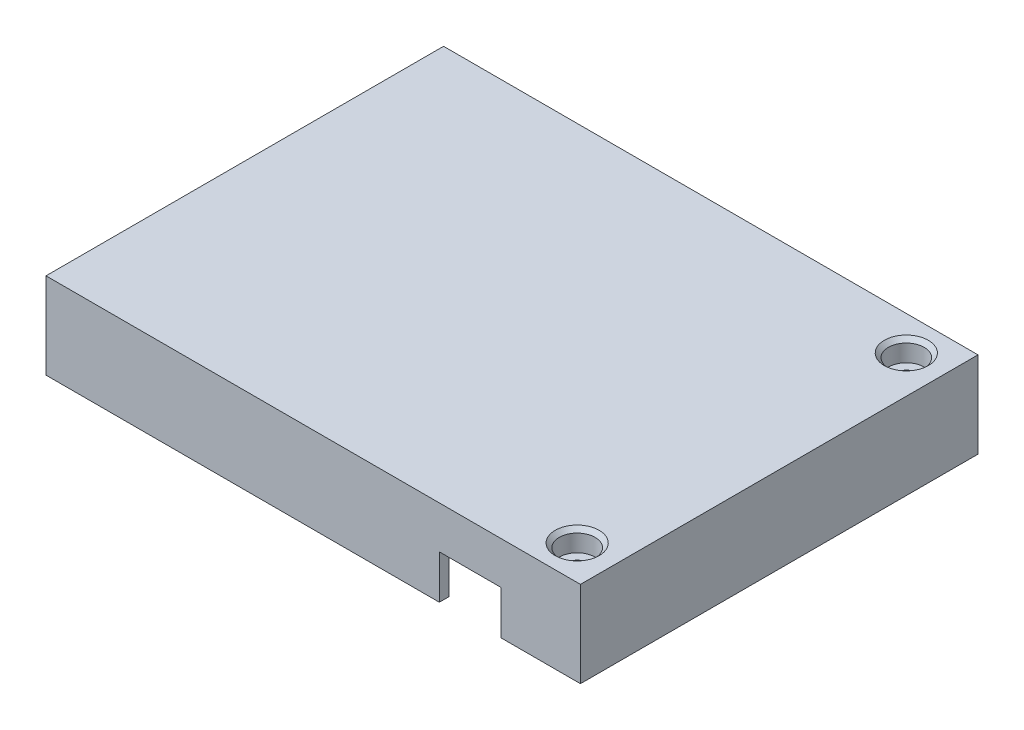
ISO-10303-21;
HEADER;
FILE_DESCRIPTION(('STEP AP214'),'2;1');
FILE_NAME('part.step','',(''),(''),'','','');
FILE_SCHEMA(('AUTOMOTIVE_DESIGN { 1 0 10303 214 1 1 1 1 }'));
ENDSEC;
DATA;
#1=APPLICATION_CONTEXT('core data for automotive mechanical design processes');
#2=APPLICATION_PROTOCOL_DEFINITION('international standard','automotive_design',2000,#1);
#3=PRODUCT_CONTEXT('',#1,'mechanical');
#4=PRODUCT('Part','Part','',(#3));
#5=PRODUCT_RELATED_PRODUCT_CATEGORY('part','',(#4));
#6=PRODUCT_DEFINITION_FORMATION('','',#4);
#7=PRODUCT_DEFINITION_CONTEXT('part definition',#1,'design');
#8=PRODUCT_DEFINITION('design','',#6,#7);
#9=PRODUCT_DEFINITION_SHAPE('','',#8);
#10=(LENGTH_UNIT() NAMED_UNIT(*) SI_UNIT(.MILLI.,.METRE.));
#11=(NAMED_UNIT(*) PLANE_ANGLE_UNIT() SI_UNIT($,.RADIAN.));
#12=(NAMED_UNIT(*) SI_UNIT($,.STERADIAN.) SOLID_ANGLE_UNIT());
#13=UNCERTAINTY_MEASURE_WITH_UNIT(LENGTH_MEASURE(1.E-05),#10,'distance_accuracy_value','');
#14=(GEOMETRIC_REPRESENTATION_CONTEXT(3) GLOBAL_UNCERTAINTY_ASSIGNED_CONTEXT((#13)) GLOBAL_UNIT_ASSIGNED_CONTEXT((#10,
#11,#12)) REPRESENTATION_CONTEXT('',''));
#15=CARTESIAN_POINT('',(0.,0.,0.));
#16=DIRECTION('',(0.,0.,1.));
#17=DIRECTION('',(1.,0.,0.));
#18=AXIS2_PLACEMENT_3D('',#15,#16,#17);
#19=CARTESIAN_POINT('',(-41.,13.2,29.));
#20=DIRECTION('',(0.,0.,-1.));
#21=DIRECTION('',(-1.,0.,0.));
#22=AXIS2_PLACEMENT_3D('',#19,#20,#21);
#23=PLANE('',#22);
#24=DIRECTION('',(-1.,0.,0.));
#25=VECTOR('',#24,1.);
#26=CARTESIAN_POINT('',(19.35,6.7,29.));
#27=LINE('',#26,#25);
#28=CARTESIAN_POINT('',(28.85,6.7,29.));
#29=VERTEX_POINT('',#28);
#30=CARTESIAN_POINT('',(19.35,6.7,29.));
#31=VERTEX_POINT('',#30);
#32=EDGE_CURVE('E244',#29,#31,#27,.T.);
#33=ORIENTED_EDGE('',*,*,#32,.T.);
#34=DIRECTION('',(0.,-1.,0.));
#35=VECTOR('',#34,1.);
#36=CARTESIAN_POINT('',(19.35,0.,29.));
#37=LINE('',#36,#35);
#38=CARTESIAN_POINT('',(19.35,0.,29.));
#39=VERTEX_POINT('',#38);
#40=EDGE_CURVE('E472',#31,#39,#37,.T.);
#41=ORIENTED_EDGE('',*,*,#40,.T.);
#42=DIRECTION('',(1.,0.,0.));
#43=VECTOR('',#42,1.);
#44=CARTESIAN_POINT('',(0.,0.,29.));
#45=LINE('',#44,#43);
#46=CARTESIAN_POINT('',(-33.15,0.,29.));
#47=VERTEX_POINT('',#46);
#48=EDGE_CURVE('E263',#47,#39,#45,.T.);
#49=ORIENTED_EDGE('',*,*,#48,.F.);
#50=DIRECTION('',(0.,1.,0.));
#51=VECTOR('',#50,1.);
#52=CARTESIAN_POINT('',(-33.15,-3.57770876399966,29.));
#53=LINE('',#52,#51);
#54=CARTESIAN_POINT('',(-33.15,1.7,29.));
#55=VERTEX_POINT('',#54);
#56=EDGE_CURVE('E421',#47,#55,#53,.T.);
#57=ORIENTED_EDGE('',*,*,#56,.T.);
#58=DIRECTION('',(1.,0.,0.));
#59=VECTOR('',#58,1.);
#60=CARTESIAN_POINT('',(-39.5,1.7,29.));
#61=LINE('',#60,#59);
#62=CARTESIAN_POINT('',(-31.75,1.7,29.));
#63=VERTEX_POINT('',#62);
#64=EDGE_CURVE('E452',#55,#63,#61,.T.);
#65=ORIENTED_EDGE('',*,*,#64,.T.);
#66=DIRECTION('',(0.,1.,0.));
#67=VECTOR('',#66,1.);
#68=CARTESIAN_POINT('',(-31.75,-10.9601551083915,29.));
#69=LINE('',#68,#67);
#70=CARTESIAN_POINT('',(-31.75,11.7,29.));
#71=VERTEX_POINT('',#70);
#72=EDGE_CURVE('E364',#63,#71,#69,.T.);
#73=ORIENTED_EDGE('',*,*,#72,.T.);
#74=DIRECTION('',(1.,0.,0.));
#75=VECTOR('',#74,1.);
#76=CARTESIAN_POINT('',(0.,11.7,29.));
#77=LINE('',#76,#75);
#78=CARTESIAN_POINT('',(31.75,11.7,29.));
#79=VERTEX_POINT('',#78);
#80=EDGE_CURVE('E297',#71,#79,#77,.T.);
#81=ORIENTED_EDGE('',*,*,#80,.T.);
#82=DIRECTION('',(0.,1.,0.));
#83=VECTOR('',#82,1.);
#84=CARTESIAN_POINT('',(31.75,-10.9601551083915,29.));
#85=LINE('',#84,#83);
#86=CARTESIAN_POINT('',(31.75,1.7,29.));
#87=VERTEX_POINT('',#86);
#88=EDGE_CURVE('E332',#87,#79,#85,.T.);
#89=ORIENTED_EDGE('',*,*,#88,.F.);
#90=DIRECTION('',(-1.,0.,0.));
#91=VECTOR('',#90,1.);
#92=CARTESIAN_POINT('',(39.5,1.7,29.));
#93=LINE('',#92,#91);
#94=CARTESIAN_POINT('',(39.5,1.7,29.));
#95=VERTEX_POINT('',#94);
#96=EDGE_CURVE('E314',#95,#87,#93,.T.);
#97=ORIENTED_EDGE('',*,*,#96,.F.);
#98=DIRECTION('',(0.,-1.,0.));
#99=VECTOR('',#98,1.);
#100=CARTESIAN_POINT('',(39.5,13.2,29.));
#101=LINE('',#100,#99);
#102=CARTESIAN_POINT('',(39.5,0.,29.));
#103=VERTEX_POINT('',#102);
#104=EDGE_CURVE('E260',#95,#103,#101,.T.);
#105=ORIENTED_EDGE('',*,*,#104,.T.);
#106=CARTESIAN_POINT('',(28.85,0.,29.));
#107=VERTEX_POINT('',#106);
#108=EDGE_CURVE('E251',#107,#103,#45,.T.);
#109=ORIENTED_EDGE('',*,*,#108,.F.);
#110=DIRECTION('',(0.,1.,0.));
#111=VECTOR('',#110,1.);
#112=CARTESIAN_POINT('',(28.85,0.,29.));
#113=LINE('',#112,#111);
#114=EDGE_CURVE('E234',#107,#29,#113,.T.);
#115=ORIENTED_EDGE('',*,*,#114,.T.);
#116=EDGE_LOOP('',(#33,#41,#49,#57,#65,#73,#81,#89,#97,#105,#109,#115));
#117=FACE_BOUND('',#116,.T.);
#118=ADVANCED_FACE('F49',(#117),#23,.T.);
#119=CARTESIAN_POINT('',(0.,0.,0.));
#120=DIRECTION('',(0.,-1.,0.));
#121=DIRECTION('',(0.,0.,-1.));
#122=AXIS2_PLACEMENT_3D('',#119,#120,#121);
#123=PLANE('',#122);
#124=ORIENTED_EDGE('',*,*,#48,.T.);
#125=DIRECTION('',(0.,0.,-1.));
#126=VECTOR('',#125,1.);
#127=CARTESIAN_POINT('',(19.35,0.,30.500012));
#128=LINE('',#127,#126);
#129=CARTESIAN_POINT('',(19.35,0.,30.5));
#130=VERTEX_POINT('',#129);
#131=EDGE_CURVE('E256',#130,#39,#128,.T.);
#132=ORIENTED_EDGE('',*,*,#131,.F.);
#133=DIRECTION('',(1.,0.,0.));
#134=VECTOR('',#133,1.);
#135=CARTESIAN_POINT('',(-41.,0.,30.5));
#136=LINE('',#135,#134);
#137=CARTESIAN_POINT('',(-41.,0.,30.5));
#138=VERTEX_POINT('',#137);
#139=EDGE_CURVE('E477',#138,#130,#136,.T.);
#140=ORIENTED_EDGE('',*,*,#139,.F.);
#141=DIRECTION('',(0.,0.,1.));
#142=VECTOR('',#141,1.);
#143=CARTESIAN_POINT('',(-41.,0.,30.5));
#144=LINE('',#143,#142);
#145=CARTESIAN_POINT('',(-41.,0.,-30.5));
#146=VERTEX_POINT('',#145);
#147=EDGE_CURVE('E498',#146,#138,#144,.T.);
#148=ORIENTED_EDGE('',*,*,#147,.F.);
#149=DIRECTION('',(-1.,0.,0.));
#150=VECTOR('',#149,1.);
#151=CARTESIAN_POINT('',(-41.,0.,-30.5));
#152=LINE('',#151,#150);
#153=CARTESIAN_POINT('',(41.,0.,-30.5));
#154=VERTEX_POINT('',#153);
#155=EDGE_CURVE('E625',#154,#146,#152,.T.);
#156=ORIENTED_EDGE('',*,*,#155,.F.);
#157=DIRECTION('',(0.,0.,-1.));
#158=VECTOR('',#157,1.);
#159=CARTESIAN_POINT('',(41.,0.,30.5));
#160=LINE('',#159,#158);
#161=CARTESIAN_POINT('',(41.,0.,30.5));
#162=VERTEX_POINT('',#161);
#163=EDGE_CURVE('E622',#162,#154,#160,.T.);
#164=ORIENTED_EDGE('',*,*,#163,.F.);
#165=CARTESIAN_POINT('',(28.85,0.,30.5));
#166=VERTEX_POINT('',#165);
#167=EDGE_CURVE('E254',#166,#162,#136,.T.);
#168=ORIENTED_EDGE('',*,*,#167,.F.);
#169=DIRECTION('',(0.,0.,-1.));
#170=VECTOR('',#169,1.);
#171=CARTESIAN_POINT('',(28.85,0.,30.500012));
#172=LINE('',#171,#170);
#173=EDGE_CURVE('E237',#166,#107,#172,.T.);
#174=ORIENTED_EDGE('',*,*,#173,.T.);
#175=ORIENTED_EDGE('',*,*,#108,.T.);
#176=DIRECTION('',(0.,0.,-1.));
#177=VECTOR('',#176,1.);
#178=CARTESIAN_POINT('',(39.5,0.,0.));
#179=LINE('',#178,#177);
#180=CARTESIAN_POINT('',(39.5,0.,-29.));
#181=VERTEX_POINT('',#180);
#182=EDGE_CURVE('E306',#103,#181,#179,.T.);
#183=ORIENTED_EDGE('',*,*,#182,.T.);
#184=DIRECTION('',(-1.,0.,0.));
#185=VECTOR('',#184,1.);
#186=CARTESIAN_POINT('',(0.,0.,-29.));
#187=LINE('',#186,#185);
#188=CARTESIAN_POINT('',(-33.15,0.,-29.));
#189=VERTEX_POINT('',#188);
#190=EDGE_CURVE('E270',#181,#189,#187,.T.);
#191=ORIENTED_EDGE('',*,*,#190,.T.);
#192=CARTESIAN_POINT('',(-34.75,0.,-29.));
#193=DIRECTION('',(0.,-1.,0.));
#194=DIRECTION('',(0.,0.,-1.));
#195=AXIS2_PLACEMENT_3D('',#192,#193,#194);
#196=CIRCLE('',#195,1.6);
#197=CARTESIAN_POINT('',(-36.35,0.,-29.));
#198=VERTEX_POINT('',#197);
#199=EDGE_CURVE('E541',#198,#189,#196,.F.);
#200=ORIENTED_EDGE('',*,*,#199,.F.);
#201=CARTESIAN_POINT('',(-39.5,0.,-29.));
#202=VERTEX_POINT('',#201);
#203=EDGE_CURVE('E73',#198,#202,#187,.T.);
#204=ORIENTED_EDGE('',*,*,#203,.T.);
#205=DIRECTION('',(0.,0.,1.));
#206=VECTOR('',#205,1.);
#207=CARTESIAN_POINT('',(-39.5,0.,0.));
#208=LINE('',#207,#206);
#209=CARTESIAN_POINT('',(-39.5,0.,29.));
#210=VERTEX_POINT('',#209);
#211=EDGE_CURVE('E264',#202,#210,#208,.T.);
#212=ORIENTED_EDGE('',*,*,#211,.T.);
#213=CARTESIAN_POINT('',(-36.35,0.,29.));
#214=VERTEX_POINT('',#213);
#215=EDGE_CURVE('E266',#210,#214,#45,.T.);
#216=ORIENTED_EDGE('',*,*,#215,.T.);
#217=CARTESIAN_POINT('',(-34.75,0.,29.));
#218=DIRECTION('',(0.,-1.,0.));
#219=DIRECTION('',(0.,0.,-1.));
#220=AXIS2_PLACEMENT_3D('',#217,#218,#219);
#221=CIRCLE('',#220,1.6);
#222=EDGE_CURVE('E422',#214,#47,#221,.T.);
#223=ORIENTED_EDGE('',*,*,#222,.T.);
#224=EDGE_LOOP('',(#124,#132,#140,#148,#156,#164,#168,#174,#175,#183,#191,#200,#204,#212,#216,#223));
#225=FACE_BOUND('',#224,.T.);
#226=ADVANCED_FACE('F249',(#225),#123,.T.);
#227=CARTESIAN_POINT('',(-41.,13.2,30.5));
#228=DIRECTION('',(0.,0.,-1.));
#229=DIRECTION('',(-1.,0.,0.));
#230=AXIS2_PLACEMENT_3D('',#227,#228,#229);
#231=PLANE('',#230);
#232=DIRECTION('',(0.,-1.,0.));
#233=VECTOR('',#232,1.);
#234=CARTESIAN_POINT('',(19.35,13.2,30.5));
#235=LINE('',#234,#233);
#236=CARTESIAN_POINT('',(19.35,6.7,30.5));
#237=VERTEX_POINT('',#236);
#238=EDGE_CURVE('E12',#237,#130,#235,.T.);
#239=ORIENTED_EDGE('',*,*,#238,.F.);
#240=DIRECTION('',(-1.,0.,0.));
#241=VECTOR('',#240,1.);
#242=CARTESIAN_POINT('',(-41.,6.7,30.5));
#243=LINE('',#242,#241);
#244=CARTESIAN_POINT('',(28.85,6.7,30.5));
#245=VERTEX_POINT('',#244);
#246=EDGE_CURVE('E517',#245,#237,#243,.T.);
#247=ORIENTED_EDGE('',*,*,#246,.F.);
#248=DIRECTION('',(0.,1.,0.));
#249=VECTOR('',#248,1.);
#250=CARTESIAN_POINT('',(28.85,13.2,30.5));
#251=LINE('',#250,#249);
#252=EDGE_CURVE('E58',#166,#245,#251,.T.);
#253=ORIENTED_EDGE('',*,*,#252,.F.);
#254=ORIENTED_EDGE('',*,*,#167,.T.);
#255=DIRECTION('',(0.,-1.,0.));
#256=VECTOR('',#255,1.);
#257=CARTESIAN_POINT('',(41.,13.2,30.5));
#258=LINE('',#257,#256);
#259=CARTESIAN_POINT('',(41.,13.2,30.5));
#260=VERTEX_POINT('',#259);
#261=EDGE_CURVE('E502',#260,#162,#258,.T.);
#262=ORIENTED_EDGE('',*,*,#261,.F.);
#263=DIRECTION('',(1.,0.,0.));
#264=VECTOR('',#263,1.);
#265=CARTESIAN_POINT('',(-41.,13.2,30.5));
#266=LINE('',#265,#264);
#267=CARTESIAN_POINT('',(-41.,13.2,30.5));
#268=VERTEX_POINT('',#267);
#269=EDGE_CURVE('E506',#268,#260,#266,.T.);
#270=ORIENTED_EDGE('',*,*,#269,.F.);
#271=DIRECTION('',(0.,-1.,0.));
#272=VECTOR('',#271,1.);
#273=CARTESIAN_POINT('',(-41.,13.2,30.5));
#274=LINE('',#273,#272);
#275=EDGE_CURVE('E489',#268,#138,#274,.T.);
#276=ORIENTED_EDGE('',*,*,#275,.T.);
#277=ORIENTED_EDGE('',*,*,#139,.T.);
#278=EDGE_LOOP('',(#239,#247,#253,#254,#262,#270,#276,#277));
#279=FACE_BOUND('',#278,.T.);
#280=ADVANCED_FACE('F485',(#279),#231,.F.);
#281=CARTESIAN_POINT('',(-41.,13.2,-29.));
#282=DIRECTION('',(0.,0.,1.));
#283=DIRECTION('',(1.,0.,0.));
#284=AXIS2_PLACEMENT_3D('',#281,#282,#283);
#285=PLANE('',#284);
#286=DIRECTION('',(0.,1.,0.));
#287=VECTOR('',#286,1.);
#288=CARTESIAN_POINT('',(-33.15,-3.57770876399966,-29.));
#289=LINE('',#288,#287);
#290=CARTESIAN_POINT('',(-33.15,1.7,-29.));
#291=VERTEX_POINT('',#290);
#292=EDGE_CURVE('E545',#189,#291,#289,.T.);
#293=ORIENTED_EDGE('',*,*,#292,.F.);
#294=ORIENTED_EDGE('',*,*,#190,.F.);
#295=DIRECTION('',(0.,-1.,0.));
#296=VECTOR('',#295,1.);
#297=CARTESIAN_POINT('',(39.5,13.2,-29.));
#298=LINE('',#297,#296);
#299=CARTESIAN_POINT('',(39.5,1.7,-29.));
#300=VERTEX_POINT('',#299);
#301=EDGE_CURVE('E292',#300,#181,#298,.T.);
#302=ORIENTED_EDGE('',*,*,#301,.F.);
#303=DIRECTION('',(-1.,0.,0.));
#304=VECTOR('',#303,1.);
#305=CARTESIAN_POINT('',(39.5,1.7,-29.));
#306=LINE('',#305,#304);
#307=CARTESIAN_POINT('',(31.75,1.7,-29.));
#308=VERTEX_POINT('',#307);
#309=EDGE_CURVE('E388',#300,#308,#306,.T.);
#310=ORIENTED_EDGE('',*,*,#309,.T.);
#311=DIRECTION('',(0.,1.,0.));
#312=VECTOR('',#311,1.);
#313=CARTESIAN_POINT('',(31.75,-10.9601551083915,-29.));
#314=LINE('',#313,#312);
#315=CARTESIAN_POINT('',(31.75,11.7,-29.));
#316=VERTEX_POINT('',#315);
#317=EDGE_CURVE('E392',#308,#316,#314,.T.);
#318=ORIENTED_EDGE('',*,*,#317,.T.);
#319=DIRECTION('',(-1.,0.,0.));
#320=VECTOR('',#319,1.);
#321=CARTESIAN_POINT('',(0.,11.7,-29.));
#322=LINE('',#321,#320);
#323=CARTESIAN_POINT('',(-31.75,11.7,-29.));
#324=VERTEX_POINT('',#323);
#325=EDGE_CURVE('E280',#316,#324,#322,.T.);
#326=ORIENTED_EDGE('',*,*,#325,.T.);
#327=DIRECTION('',(0.,1.,0.));
#328=VECTOR('',#327,1.);
#329=CARTESIAN_POINT('',(-31.75,-10.9601551083915,-29.));
#330=LINE('',#329,#328);
#331=CARTESIAN_POINT('',(-31.75,1.7,-29.));
#332=VERTEX_POINT('',#331);
#333=EDGE_CURVE('E576',#332,#324,#330,.T.);
#334=ORIENTED_EDGE('',*,*,#333,.F.);
#335=DIRECTION('',(1.,0.,0.));
#336=VECTOR('',#335,1.);
#337=CARTESIAN_POINT('',(-39.5,1.7,-29.));
#338=LINE('',#337,#336);
#339=EDGE_CURVE('E583',#291,#332,#338,.T.);
#340=ORIENTED_EDGE('',*,*,#339,.F.);
#341=EDGE_LOOP('',(#293,#294,#302,#310,#318,#326,#334,#340));
#342=FACE_BOUND('',#341,.T.);
#343=ADVANCED_FACE('F607',(#342),#285,.T.);
#344=CARTESIAN_POINT('',(0.,11.7,0.));
#345=DIRECTION('',(0.,-1.,0.));
#346=DIRECTION('',(0.,0.,-1.));
#347=AXIS2_PLACEMENT_3D('',#344,#345,#346);
#348=PLANE('',#347);
#349=DIRECTION('',(-1.,0.,0.));
#350=VECTOR('',#349,1.);
#351=CARTESIAN_POINT('',(-39.5,11.7,-21.25));
#352=LINE('',#351,#350);
#353=CARTESIAN_POINT('',(-31.75,11.7,-21.25));
#354=VERTEX_POINT('',#353);
#355=CARTESIAN_POINT('',(-39.5,11.7,-21.25));
#356=VERTEX_POINT('',#355);
#357=EDGE_CURVE('E566',#354,#356,#352,.T.);
#358=ORIENTED_EDGE('',*,*,#357,.F.);
#359=DIRECTION('',(0.,0.,1.));
#360=VECTOR('',#359,1.);
#361=CARTESIAN_POINT('',(-31.75,11.7,-29.));
#362=LINE('',#361,#360);
#363=EDGE_CURVE('E572',#324,#354,#362,.T.);
#364=ORIENTED_EDGE('',*,*,#363,.F.);
#365=ORIENTED_EDGE('',*,*,#325,.F.);
#366=DIRECTION('',(0.,0.,1.));
#367=VECTOR('',#366,1.);
#368=CARTESIAN_POINT('',(31.75,11.7,-29.));
#369=LINE('',#368,#367);
#370=CARTESIAN_POINT('',(31.75,11.7,-21.25));
#371=VERTEX_POINT('',#370);
#372=EDGE_CURVE('E383',#316,#371,#369,.T.);
#373=ORIENTED_EDGE('',*,*,#372,.T.);
#374=DIRECTION('',(1.,0.,0.));
#375=VECTOR('',#374,1.);
#376=CARTESIAN_POINT('',(39.5,11.7,-21.25));
#377=LINE('',#376,#375);
#378=CARTESIAN_POINT('',(39.5,11.7,-21.25));
#379=VERTEX_POINT('',#378);
#380=EDGE_CURVE('E380',#371,#379,#377,.T.);
#381=ORIENTED_EDGE('',*,*,#380,.T.);
#382=DIRECTION('',(0.,0.,-1.));
#383=VECTOR('',#382,1.);
#384=CARTESIAN_POINT('',(39.5,11.7,0.));
#385=LINE('',#384,#383);
#386=CARTESIAN_POINT('',(39.5,11.7,21.25));
#387=VERTEX_POINT('',#386);
#388=EDGE_CURVE('E275',#387,#379,#385,.T.);
#389=ORIENTED_EDGE('',*,*,#388,.F.);
#390=DIRECTION('',(1.,0.,0.));
#391=VECTOR('',#390,1.);
#392=CARTESIAN_POINT('',(39.5,11.7,21.25));
#393=LINE('',#392,#391);
#394=CARTESIAN_POINT('',(31.75,11.7,21.25));
#395=VERTEX_POINT('',#394);
#396=EDGE_CURVE('E331',#395,#387,#393,.T.);
#397=ORIENTED_EDGE('',*,*,#396,.F.);
#398=DIRECTION('',(0.,0.,-1.));
#399=VECTOR('',#398,1.);
#400=CARTESIAN_POINT('',(31.75,11.7,29.));
#401=LINE('',#400,#399);
#402=EDGE_CURVE('E323',#79,#395,#401,.T.);
#403=ORIENTED_EDGE('',*,*,#402,.F.);
#404=ORIENTED_EDGE('',*,*,#80,.F.);
#405=DIRECTION('',(0.,0.,-1.));
#406=VECTOR('',#405,1.);
#407=CARTESIAN_POINT('',(-31.75,11.7,29.));
#408=LINE('',#407,#406);
#409=CARTESIAN_POINT('',(-31.75,11.7,21.25));
#410=VERTEX_POINT('',#409);
#411=EDGE_CURVE('E447',#71,#410,#408,.T.);
#412=ORIENTED_EDGE('',*,*,#411,.T.);
#413=DIRECTION('',(-1.,0.,0.));
#414=VECTOR('',#413,1.);
#415=CARTESIAN_POINT('',(-39.5,11.7,21.25));
#416=LINE('',#415,#414);
#417=CARTESIAN_POINT('',(-39.5,11.7,21.25));
#418=VERTEX_POINT('',#417);
#419=EDGE_CURVE('E449',#410,#418,#416,.T.);
#420=ORIENTED_EDGE('',*,*,#419,.T.);
#421=DIRECTION('',(0.,0.,1.));
#422=VECTOR('',#421,1.);
#423=CARTESIAN_POINT('',(-39.5,11.7,0.));
#424=LINE('',#423,#422);
#425=EDGE_CURVE('E288',#356,#418,#424,.T.);
#426=ORIENTED_EDGE('',*,*,#425,.F.);
#427=EDGE_LOOP('',(#358,#364,#365,#373,#381,#389,#397,#403,#404,#412,#420,#426));
#428=FACE_BOUND('',#427,.T.);
#429=ADVANCED_FACE('F377',(#428),#348,.T.);
#430=DIRECTION('',(0.,1.,0.));
#431=VECTOR('',#430,1.);
#432=CARTESIAN_POINT('',(-36.35,-3.57770876399966,-29.));
#433=LINE('',#432,#431);
#434=CARTESIAN_POINT('',(-36.35,1.7,-29.));
#435=VERTEX_POINT('',#434);
#436=EDGE_CURVE('E540',#198,#435,#433,.T.);
#437=ORIENTED_EDGE('',*,*,#436,.T.);
#438=CARTESIAN_POINT('',(-39.5,1.7,-29.));
#439=VERTEX_POINT('',#438);
#440=EDGE_CURVE('E580',#439,#435,#338,.T.);
#441=ORIENTED_EDGE('',*,*,#440,.F.);
#442=DIRECTION('',(0.,-1.,0.));
#443=VECTOR('',#442,1.);
#444=CARTESIAN_POINT('',(-39.5,13.2,-29.));
#445=LINE('',#444,#443);
#446=EDGE_CURVE('E298',#439,#202,#445,.T.);
#447=ORIENTED_EDGE('',*,*,#446,.T.);
#448=ORIENTED_EDGE('',*,*,#203,.F.);
#449=EDGE_LOOP('',(#437,#441,#447,#448));
#450=FACE_BOUND('',#449,.T.);
#451=ADVANCED_FACE('F643',(#450),#285,.T.);
#452=CARTESIAN_POINT('',(-39.5,13.2,30.5));
#453=DIRECTION('',(1.,0.,0.));
#454=DIRECTION('',(0.,0.,-1.));
#455=AXIS2_PLACEMENT_3D('',#452,#453,#454);
#456=PLANE('',#455);
#457=DIRECTION('',(0.,0.,-1.));
#458=VECTOR('',#457,1.);
#459=CARTESIAN_POINT('',(-39.5,1.7,-29.));
#460=LINE('',#459,#458);
#461=CARTESIAN_POINT('',(-39.5,1.7,-21.25));
#462=VERTEX_POINT('',#461);
#463=EDGE_CURVE('E584',#462,#439,#460,.T.);
#464=ORIENTED_EDGE('',*,*,#463,.F.);
#465=DIRECTION('',(0.,1.,0.));
#466=VECTOR('',#465,1.);
#467=CARTESIAN_POINT('',(-39.5,-10.9601551083915,-21.25));
#468=LINE('',#467,#466);
#469=EDGE_CURVE('E525',#462,#356,#468,.T.);
#470=ORIENTED_EDGE('',*,*,#469,.T.);
#471=ORIENTED_EDGE('',*,*,#425,.T.);
#472=DIRECTION('',(0.,1.,0.));
#473=VECTOR('',#472,1.);
#474=CARTESIAN_POINT('',(-39.5,-10.9601551083915,21.25));
#475=LINE('',#474,#473);
#476=CARTESIAN_POINT('',(-39.5,1.7,21.25));
#477=VERTEX_POINT('',#476);
#478=EDGE_CURVE('E344',#477,#418,#475,.T.);
#479=ORIENTED_EDGE('',*,*,#478,.F.);
#480=DIRECTION('',(0.,0.,1.));
#481=VECTOR('',#480,1.);
#482=CARTESIAN_POINT('',(-39.5,1.7,29.));
#483=LINE('',#482,#481);
#484=CARTESIAN_POINT('',(-39.5,1.7,29.));
#485=VERTEX_POINT('',#484);
#486=EDGE_CURVE('E341',#477,#485,#483,.T.);
#487=ORIENTED_EDGE('',*,*,#486,.T.);
#488=DIRECTION('',(0.,-1.,0.));
#489=VECTOR('',#488,1.);
#490=CARTESIAN_POINT('',(-39.5,13.2,29.));
#491=LINE('',#490,#489);
#492=EDGE_CURVE('E296',#485,#210,#491,.T.);
#493=ORIENTED_EDGE('',*,*,#492,.T.);
#494=ORIENTED_EDGE('',*,*,#211,.F.);
#495=ORIENTED_EDGE('',*,*,#446,.F.);
#496=EDGE_LOOP('',(#464,#470,#471,#479,#487,#493,#494,#495));
#497=FACE_BOUND('',#496,.T.);
#498=ADVANCED_FACE('F598',(#497),#456,.T.);
#499=CARTESIAN_POINT('',(-36.35,1.7,29.));
#500=VERTEX_POINT('',#499);
#501=EDGE_CURVE('E355',#485,#500,#61,.T.);
#502=ORIENTED_EDGE('',*,*,#501,.T.);
#503=DIRECTION('',(0.,1.,0.));
#504=VECTOR('',#503,1.);
#505=CARTESIAN_POINT('',(-36.35,-3.57770876399966,29.));
#506=LINE('',#505,#504);
#507=EDGE_CURVE('E401',#214,#500,#506,.T.);
#508=ORIENTED_EDGE('',*,*,#507,.F.);
#509=ORIENTED_EDGE('',*,*,#215,.F.);
#510=ORIENTED_EDGE('',*,*,#492,.F.);
#511=EDGE_LOOP('',(#502,#508,#509,#510));
#512=FACE_BOUND('',#511,.T.);
#513=ADVANCED_FACE('F463',(#512),#23,.T.);
#514=CARTESIAN_POINT('',(0.,1.7,0.));
#515=DIRECTION('',(0.,-1.,0.));
#516=DIRECTION('',(0.,0.,-1.));
#517=AXIS2_PLACEMENT_3D('',#514,#515,#516);
#518=PLANE('',#517);
#519=ORIENTED_EDGE('',*,*,#64,.F.);
#520=CARTESIAN_POINT('',(-34.75,1.7,29.));
#521=DIRECTION('',(0.,-1.,0.));
#522=DIRECTION('',(0.,0.,-1.));
#523=AXIS2_PLACEMENT_3D('',#520,#521,#522);
#524=CIRCLE('',#523,1.6);
#525=EDGE_CURVE('E418',#500,#55,#524,.T.);
#526=ORIENTED_EDGE('',*,*,#525,.F.);
#527=ORIENTED_EDGE('',*,*,#501,.F.);
#528=ORIENTED_EDGE('',*,*,#486,.F.);
#529=DIRECTION('',(-1.,0.,0.));
#530=VECTOR('',#529,1.);
#531=CARTESIAN_POINT('',(-39.5,1.7,21.25));
#532=LINE('',#531,#530);
#533=CARTESIAN_POINT('',(-31.75,1.7,21.25));
#534=VERTEX_POINT('',#533);
#535=EDGE_CURVE('E351',#534,#477,#532,.T.);
#536=ORIENTED_EDGE('',*,*,#535,.F.);
#537=DIRECTION('',(0.,0.,-1.));
#538=VECTOR('',#537,1.);
#539=CARTESIAN_POINT('',(-31.75,1.7,29.));
#540=LINE('',#539,#538);
#541=EDGE_CURVE('E361',#63,#534,#540,.T.);
#542=ORIENTED_EDGE('',*,*,#541,.F.);
#543=EDGE_LOOP('',(#519,#526,#527,#528,#536,#542));
#544=FACE_BOUND('',#543,.T.);
#545=ADVANCED_FACE('F466',(#544),#518,.T.);
#546=CARTESIAN_POINT('',(39.5,13.2,30.5));
#547=DIRECTION('',(-1.,0.,0.));
#548=DIRECTION('',(0.,0.,1.));
#549=AXIS2_PLACEMENT_3D('',#546,#547,#548);
#550=PLANE('',#549);
#551=DIRECTION('',(0.,0.,-1.));
#552=VECTOR('',#551,1.);
#553=CARTESIAN_POINT('',(39.5,1.7,-29.));
#554=LINE('',#553,#552);
#555=CARTESIAN_POINT('',(39.5,1.7,-21.25));
#556=VERTEX_POINT('',#555);
#557=EDGE_CURVE('E398',#556,#300,#554,.T.);
#558=ORIENTED_EDGE('',*,*,#557,.T.);
#559=ORIENTED_EDGE('',*,*,#301,.T.);
#560=ORIENTED_EDGE('',*,*,#182,.F.);
#561=ORIENTED_EDGE('',*,*,#104,.F.);
#562=DIRECTION('',(0.,0.,1.));
#563=VECTOR('',#562,1.);
#564=CARTESIAN_POINT('',(39.5,1.7,29.));
#565=LINE('',#564,#563);
#566=CARTESIAN_POINT('',(39.5,1.7,21.25));
#567=VERTEX_POINT('',#566);
#568=EDGE_CURVE('E320',#567,#95,#565,.T.);
#569=ORIENTED_EDGE('',*,*,#568,.F.);
#570=DIRECTION('',(0.,1.,0.));
#571=VECTOR('',#570,1.);
#572=CARTESIAN_POINT('',(39.5,-10.9601551083915,21.25));
#573=LINE('',#572,#571);
#574=EDGE_CURVE('E336',#567,#387,#573,.T.);
#575=ORIENTED_EDGE('',*,*,#574,.T.);
#576=ORIENTED_EDGE('',*,*,#388,.T.);
#577=DIRECTION('',(0.,1.,0.));
#578=VECTOR('',#577,1.);
#579=CARTESIAN_POINT('',(39.5,-10.9601551083915,-21.25));
#580=LINE('',#579,#578);
#581=EDGE_CURVE('E402',#556,#379,#580,.T.);
#582=ORIENTED_EDGE('',*,*,#581,.F.);
#583=EDGE_LOOP('',(#558,#559,#560,#561,#569,#575,#576,#582));
#584=FACE_BOUND('',#583,.T.);
#585=ADVANCED_FACE('F619',(#584),#550,.T.);
#586=CARTESIAN_POINT('',(41.,13.2,30.5));
#587=DIRECTION('',(-1.,0.,0.));
#588=DIRECTION('',(0.,0.,1.));
#589=AXIS2_PLACEMENT_3D('',#586,#587,#588);
#590=PLANE('',#589);
#591=ORIENTED_EDGE('',*,*,#163,.T.);
#592=DIRECTION('',(0.,-1.,0.));
#593=VECTOR('',#592,1.);
#594=CARTESIAN_POINT('',(41.,13.2,-30.5));
#595=LINE('',#594,#593);
#596=CARTESIAN_POINT('',(41.,13.2,-30.5));
#597=VERTEX_POINT('',#596);
#598=EDGE_CURVE('E513',#597,#154,#595,.T.);
#599=ORIENTED_EDGE('',*,*,#598,.F.);
#600=DIRECTION('',(0.,0.,-1.));
#601=VECTOR('',#600,1.);
#602=CARTESIAN_POINT('',(41.,13.2,30.5));
#603=LINE('',#602,#601);
#604=EDGE_CURVE('E491',#260,#597,#603,.T.);
#605=ORIENTED_EDGE('',*,*,#604,.F.);
#606=ORIENTED_EDGE('',*,*,#261,.T.);
#607=EDGE_LOOP('',(#591,#599,#605,#606));
#608=FACE_BOUND('',#607,.T.);
#609=ADVANCED_FACE('F51',(#608),#590,.F.);
#610=CARTESIAN_POINT('',(-41.,13.2,-30.5));
#611=DIRECTION('',(0.,0.,1.));
#612=DIRECTION('',(1.,0.,0.));
#613=AXIS2_PLACEMENT_3D('',#610,#611,#612);
#614=PLANE('',#613);
#615=ORIENTED_EDGE('',*,*,#155,.T.);
#616=DIRECTION('',(0.,-1.,0.));
#617=VECTOR('',#616,1.);
#618=CARTESIAN_POINT('',(-41.,13.2,-30.5));
#619=LINE('',#618,#617);
#620=CARTESIAN_POINT('',(-41.,13.2,-30.5));
#621=VERTEX_POINT('',#620);
#622=EDGE_CURVE('E509',#621,#146,#619,.T.);
#623=ORIENTED_EDGE('',*,*,#622,.F.);
#624=DIRECTION('',(-1.,0.,0.));
#625=VECTOR('',#624,1.);
#626=CARTESIAN_POINT('',(-41.,13.2,-30.5));
#627=LINE('',#626,#625);
#628=EDGE_CURVE('E496',#597,#621,#627,.T.);
#629=ORIENTED_EDGE('',*,*,#628,.F.);
#630=ORIENTED_EDGE('',*,*,#598,.T.);
#631=EDGE_LOOP('',(#615,#623,#629,#630));
#632=FACE_BOUND('',#631,.T.);
#633=ADVANCED_FACE('F967',(#632),#614,.F.);
#634=CARTESIAN_POINT('',(-41.,13.2,30.5));
#635=DIRECTION('',(1.,0.,0.));
#636=DIRECTION('',(0.,0.,-1.));
#637=AXIS2_PLACEMENT_3D('',#634,#635,#636);
#638=PLANE('',#637);
#639=ORIENTED_EDGE('',*,*,#147,.T.);
#640=ORIENTED_EDGE('',*,*,#275,.F.);
#641=DIRECTION('',(0.,0.,1.));
#642=VECTOR('',#641,1.);
#643=CARTESIAN_POINT('',(-41.,13.2,30.5));
#644=LINE('',#643,#642);
#645=EDGE_CURVE('E633',#621,#268,#644,.T.);
#646=ORIENTED_EDGE('',*,*,#645,.F.);
#647=ORIENTED_EDGE('',*,*,#622,.T.);
#648=EDGE_LOOP('',(#639,#640,#646,#647));
#649=FACE_BOUND('',#648,.T.);
#650=ADVANCED_FACE('F957',(#649),#638,.F.);
#651=CARTESIAN_POINT('',(0.,13.2,0.));
#652=DIRECTION('',(0.,-1.,0.));
#653=DIRECTION('',(0.,0.,-1.));
#654=AXIS2_PLACEMENT_3D('',#651,#652,#653);
#655=PLANE('',#654);
#656=CARTESIAN_POINT('',(35.25,13.2,-25.25));
#657=DIRECTION('',(0.,1.,0.));
#658=DIRECTION('',(0.,0.,1.));
#659=AXIS2_PLACEMENT_3D('',#656,#657,#658);
#660=CIRCLE('',#659,3.375);
#661=CARTESIAN_POINT('',(35.25,13.2,-21.875));
#662=VERTEX_POINT('',#661);
#663=EDGE_CURVE('E551',#662,#662,#660,.T.);
#664=ORIENTED_EDGE('',*,*,#663,.F.);
#665=EDGE_LOOP('',(#664));
#666=FACE_BOUND('',#665,.T.);
#667=CARTESIAN_POINT('',(35.25,13.2,25.25));
#668=DIRECTION('',(0.,1.,0.));
#669=DIRECTION('',(0.,0.,1.));
#670=AXIS2_PLACEMENT_3D('',#667,#668,#669);
#671=CIRCLE('',#670,3.375);
#672=CARTESIAN_POINT('',(35.25,13.2,28.625));
#673=VERTEX_POINT('',#672);
#674=EDGE_CURVE('E425',#673,#673,#671,.T.);
#675=ORIENTED_EDGE('',*,*,#674,.F.);
#676=EDGE_LOOP('',(#675));
#677=FACE_BOUND('',#676,.T.);
#678=ORIENTED_EDGE('',*,*,#604,.T.);
#679=ORIENTED_EDGE('',*,*,#628,.T.);
#680=ORIENTED_EDGE('',*,*,#645,.T.);
#681=ORIENTED_EDGE('',*,*,#269,.T.);
#682=EDGE_LOOP('',(#678,#679,#680,#681));
#683=FACE_BOUND('',#682,.T.);
#684=ADVANCED_FACE('F692',(#666,#677,#683),#655,.F.);
#685=CARTESIAN_POINT('',(31.75,-10.9601551083915,29.));
#686=DIRECTION('',(1.,0.,0.));
#687=DIRECTION('',(0.,0.,-1.));
#688=AXIS2_PLACEMENT_3D('',#685,#686,#687);
#689=PLANE('',#688);
#690=DIRECTION('',(0.,0.,-1.));
#691=VECTOR('',#690,1.);
#692=CARTESIAN_POINT('',(31.75,1.7,29.));
#693=LINE('',#692,#691);
#694=CARTESIAN_POINT('',(31.75,1.7,21.25));
#695=VERTEX_POINT('',#694);
#696=EDGE_CURVE('E308',#87,#695,#693,.T.);
#697=ORIENTED_EDGE('',*,*,#696,.F.);
#698=ORIENTED_EDGE('',*,*,#88,.T.);
#699=ORIENTED_EDGE('',*,*,#402,.T.);
#700=DIRECTION('',(0.,1.,0.));
#701=VECTOR('',#700,1.);
#702=CARTESIAN_POINT('',(31.75,-10.9601551083915,21.25));
#703=LINE('',#702,#701);
#704=EDGE_CURVE('E337',#695,#395,#703,.T.);
#705=ORIENTED_EDGE('',*,*,#704,.F.);
#706=EDGE_LOOP('',(#697,#698,#699,#705));
#707=FACE_BOUND('',#706,.T.);
#708=ADVANCED_FACE('F689',(#707),#689,.F.);
#709=CARTESIAN_POINT('',(39.5,-10.9601551083915,21.25));
#710=DIRECTION('',(0.,0.,1.));
#711=DIRECTION('',(1.,0.,0.));
#712=AXIS2_PLACEMENT_3D('',#709,#710,#711);
#713=PLANE('',#712);
#714=DIRECTION('',(1.,0.,0.));
#715=VECTOR('',#714,1.);
#716=CARTESIAN_POINT('',(39.5,1.7,21.25));
#717=LINE('',#716,#715);
#718=EDGE_CURVE('E328',#695,#567,#717,.T.);
#719=ORIENTED_EDGE('',*,*,#718,.F.);
#720=ORIENTED_EDGE('',*,*,#704,.T.);
#721=ORIENTED_EDGE('',*,*,#396,.T.);
#722=ORIENTED_EDGE('',*,*,#574,.F.);
#723=EDGE_LOOP('',(#719,#720,#721,#722));
#724=FACE_BOUND('',#723,.T.);
#725=ADVANCED_FACE('F374',(#724),#713,.F.);
#726=CARTESIAN_POINT('',(0.,1.7,0.));
#727=DIRECTION('',(0.,-1.,0.));
#728=DIRECTION('',(0.,0.,-1.));
#729=AXIS2_PLACEMENT_3D('',#726,#727,#728);
#730=PLANE('',#729);
#731=CARTESIAN_POINT('',(35.25,1.7,25.25));
#732=DIRECTION('',(0.,-1.,0.));
#733=DIRECTION('',(0.,0.,-1.));
#734=AXIS2_PLACEMENT_3D('',#731,#732,#733);
#735=CIRCLE('',#734,1.375);
#736=CARTESIAN_POINT('',(35.25,1.7,23.875));
#737=VERTEX_POINT('',#736);
#738=EDGE_CURVE('E446',#737,#737,#735,.T.);
#739=ORIENTED_EDGE('',*,*,#738,.F.);
#740=EDGE_LOOP('',(#739));
#741=FACE_BOUND('',#740,.T.);
#742=ORIENTED_EDGE('',*,*,#718,.T.);
#743=ORIENTED_EDGE('',*,*,#568,.T.);
#744=ORIENTED_EDGE('',*,*,#96,.T.);
#745=ORIENTED_EDGE('',*,*,#696,.T.);
#746=EDGE_LOOP('',(#742,#743,#744,#745));
#747=FACE_BOUND('',#746,.T.);
#748=ADVANCED_FACE('F684',(#741,#747),#730,.T.);
#749=CARTESIAN_POINT('',(-31.75,-10.9601551083915,29.));
#750=DIRECTION('',(1.,0.,0.));
#751=DIRECTION('',(0.,0.,-1.));
#752=AXIS2_PLACEMENT_3D('',#749,#750,#751);
#753=PLANE('',#752);
#754=ORIENTED_EDGE('',*,*,#72,.F.);
#755=ORIENTED_EDGE('',*,*,#541,.T.);
#756=DIRECTION('',(0.,1.,0.));
#757=VECTOR('',#756,1.);
#758=CARTESIAN_POINT('',(-31.75,-10.9601551083915,21.25));
#759=LINE('',#758,#757);
#760=EDGE_CURVE('E360',#534,#410,#759,.T.);
#761=ORIENTED_EDGE('',*,*,#760,.T.);
#762=ORIENTED_EDGE('',*,*,#411,.F.);
#763=EDGE_LOOP('',(#754,#755,#761,#762));
#764=FACE_BOUND('',#763,.T.);
#765=ADVANCED_FACE('F687',(#764),#753,.T.);
#766=CARTESIAN_POINT('',(-39.5,-10.9601551083915,21.25));
#767=DIRECTION('',(0.,0.,-1.));
#768=DIRECTION('',(-1.,0.,0.));
#769=AXIS2_PLACEMENT_3D('',#766,#767,#768);
#770=PLANE('',#769);
#771=ORIENTED_EDGE('',*,*,#760,.F.);
#772=ORIENTED_EDGE('',*,*,#535,.T.);
#773=ORIENTED_EDGE('',*,*,#478,.T.);
#774=ORIENTED_EDGE('',*,*,#419,.F.);
#775=EDGE_LOOP('',(#771,#772,#773,#774));
#776=FACE_BOUND('',#775,.T.);
#777=ADVANCED_FACE('F698',(#776),#770,.T.);
#778=CARTESIAN_POINT('',(35.25,13.2,25.25));
#779=DIRECTION('',(0.,1.,0.));
#780=DIRECTION('',(0.,0.,1.));
#781=AXIS2_PLACEMENT_3D('',#778,#779,#780);
#782=CYLINDRICAL_SURFACE('',#781,1.375);
#783=ORIENTED_EDGE('',*,*,#738,.T.);
#784=EDGE_LOOP('',(#783));
#785=FACE_BOUND('',#784,.T.);
#786=CARTESIAN_POINT('',(35.25,9.95,25.25));
#787=DIRECTION('',(0.,1.,0.));
#788=DIRECTION('',(0.,0.,1.));
#789=AXIS2_PLACEMENT_3D('',#786,#787,#788);
#790=CIRCLE('',#789,1.375);
#791=CARTESIAN_POINT('',(35.25,9.95,26.625));
#792=VERTEX_POINT('',#791);
#793=EDGE_CURVE('E442',#792,#792,#790,.T.);
#794=ORIENTED_EDGE('',*,*,#793,.T.);
#795=EDGE_LOOP('',(#794));
#796=FACE_BOUND('',#795,.T.);
#797=ADVANCED_FACE('F702',(#785,#796),#782,.F.);
#798=CARTESIAN_POINT('',(38.,9.95,25.25));
#799=DIRECTION('',(0.,-1.,0.));
#800=DIRECTION('',(0.,0.,-1.));
#801=AXIS2_PLACEMENT_3D('',#798,#799,#800);
#802=PLANE('',#801);
#803=ORIENTED_EDGE('',*,*,#793,.F.);
#804=EDGE_LOOP('',(#803));
#805=FACE_BOUND('',#804,.T.);
#806=CARTESIAN_POINT('',(35.25,9.95,25.25));
#807=DIRECTION('',(0.,1.,0.));
#808=DIRECTION('',(0.,0.,1.));
#809=AXIS2_PLACEMENT_3D('',#806,#807,#808);
#810=CIRCLE('',#809,2.75);
#811=CARTESIAN_POINT('',(35.25,9.95,28.));
#812=VERTEX_POINT('',#811);
#813=EDGE_CURVE('E438',#812,#812,#810,.T.);
#814=ORIENTED_EDGE('',*,*,#813,.T.);
#815=EDGE_LOOP('',(#814));
#816=FACE_BOUND('',#815,.T.);
#817=ADVANCED_FACE('F706',(#805,#816),#802,.F.);
#818=CARTESIAN_POINT('',(35.25,13.2,25.25));
#819=DIRECTION('',(0.,1.,0.));
#820=DIRECTION('',(0.,0.,1.));
#821=AXIS2_PLACEMENT_3D('',#818,#819,#820);
#822=CYLINDRICAL_SURFACE('',#821,2.75);
#823=ORIENTED_EDGE('',*,*,#813,.F.);
#824=EDGE_LOOP('',(#823));
#825=FACE_BOUND('',#824,.T.);
#826=CARTESIAN_POINT('',(35.25,12.575,25.25));
#827=DIRECTION('',(0.,1.,0.));
#828=DIRECTION('',(0.,0.,1.));
#829=AXIS2_PLACEMENT_3D('',#826,#827,#828);
#830=CIRCLE('',#829,2.75);
#831=CARTESIAN_POINT('',(35.25,12.575,28.));
#832=VERTEX_POINT('',#831);
#833=EDGE_CURVE('E434',#832,#832,#830,.T.);
#834=ORIENTED_EDGE('',*,*,#833,.T.);
#835=EDGE_LOOP('',(#834));
#836=FACE_BOUND('',#835,.T.);
#837=ADVANCED_FACE('F710',(#825,#836),#822,.F.);
#838=CARTESIAN_POINT('',(35.25,13.2,25.25));
#839=DIRECTION('',(0.,1.,0.));
#840=DIRECTION('',(0.,0.,1.));
#841=AXIS2_PLACEMENT_3D('',#838,#839,#840);
#842=CONICAL_SURFACE('',#841,3.375,0.785398163397454);
#843=ORIENTED_EDGE('',*,*,#833,.F.);
#844=EDGE_LOOP('',(#843));
#845=FACE_BOUND('',#844,.T.);
#846=ORIENTED_EDGE('',*,*,#674,.T.);
#847=EDGE_LOOP('',(#846));
#848=FACE_BOUND('',#847,.T.);
#849=ADVANCED_FACE('F714',(#845,#848),#842,.F.);
#850=CARTESIAN_POINT('',(-34.75,-3.57770876399966,29.));
#851=DIRECTION('',(0.,1.,0.));
#852=DIRECTION('',(0.,0.,1.));
#853=AXIS2_PLACEMENT_3D('',#850,#851,#852);
#854=CYLINDRICAL_SURFACE('',#853,1.6);
#855=ORIENTED_EDGE('',*,*,#222,.F.);
#856=ORIENTED_EDGE('',*,*,#507,.T.);
#857=ORIENTED_EDGE('',*,*,#525,.T.);
#858=ORIENTED_EDGE('',*,*,#56,.F.);
#859=EDGE_LOOP('',(#855,#856,#857,#858));
#860=FACE_BOUND('',#859,.T.);
#861=ADVANCED_FACE('F468',(#860),#854,.T.);
#862=CARTESIAN_POINT('',(0.,1.7,0.));
#863=DIRECTION('',(0.,-1.,0.));
#864=DIRECTION('',(0.,0.,-1.));
#865=AXIS2_PLACEMENT_3D('',#862,#863,#864);
#866=PLANE('',#865);
#867=CARTESIAN_POINT('',(35.25,1.7,-25.25));
#868=DIRECTION('',(0.,-1.,0.));
#869=DIRECTION('',(0.,0.,-1.));
#870=AXIS2_PLACEMENT_3D('',#867,#868,#869);
#871=CIRCLE('',#870,1.375);
#872=CARTESIAN_POINT('',(35.25,1.7,-26.625));
#873=VERTEX_POINT('',#872);
#874=EDGE_CURVE('E521',#873,#873,#871,.T.);
#875=ORIENTED_EDGE('',*,*,#874,.F.);
#876=EDGE_LOOP('',(#875));
#877=FACE_BOUND('',#876,.T.);
#878=ORIENTED_EDGE('',*,*,#557,.F.);
#879=DIRECTION('',(1.,0.,0.));
#880=VECTOR('',#879,1.);
#881=CARTESIAN_POINT('',(39.5,1.7,-21.25));
#882=LINE('',#881,#880);
#883=CARTESIAN_POINT('',(31.75,1.7,-21.25));
#884=VERTEX_POINT('',#883);
#885=EDGE_CURVE('E403',#884,#556,#882,.T.);
#886=ORIENTED_EDGE('',*,*,#885,.F.);
#887=DIRECTION('',(0.,0.,1.));
#888=VECTOR('',#887,1.);
#889=CARTESIAN_POINT('',(31.75,1.7,-29.));
#890=LINE('',#889,#888);
#891=EDGE_CURVE('E408',#308,#884,#890,.T.);
#892=ORIENTED_EDGE('',*,*,#891,.F.);
#893=ORIENTED_EDGE('',*,*,#309,.F.);
#894=EDGE_LOOP('',(#878,#886,#892,#893));
#895=FACE_BOUND('',#894,.T.);
#896=ADVANCED_FACE('F618',(#877,#895),#866,.T.);
#897=CARTESIAN_POINT('',(31.75,-10.9601551083915,-29.));
#898=DIRECTION('',(-1.,0.,0.));
#899=DIRECTION('',(0.,0.,1.));
#900=AXIS2_PLACEMENT_3D('',#897,#898,#899);
#901=PLANE('',#900);
#902=ORIENTED_EDGE('',*,*,#317,.F.);
#903=ORIENTED_EDGE('',*,*,#891,.T.);
#904=DIRECTION('',(0.,1.,0.));
#905=VECTOR('',#904,1.);
#906=CARTESIAN_POINT('',(31.75,-10.9601551083915,-21.25));
#907=LINE('',#906,#905);
#908=EDGE_CURVE('E407',#884,#371,#907,.T.);
#909=ORIENTED_EDGE('',*,*,#908,.T.);
#910=ORIENTED_EDGE('',*,*,#372,.F.);
#911=EDGE_LOOP('',(#902,#903,#909,#910));
#912=FACE_BOUND('',#911,.T.);
#913=ADVANCED_FACE('F614',(#912),#901,.T.);
#914=CARTESIAN_POINT('',(39.5,-10.9601551083915,-21.25));
#915=DIRECTION('',(0.,0.,1.));
#916=DIRECTION('',(1.,0.,0.));
#917=AXIS2_PLACEMENT_3D('',#914,#915,#916);
#918=PLANE('',#917);
#919=ORIENTED_EDGE('',*,*,#908,.F.);
#920=ORIENTED_EDGE('',*,*,#885,.T.);
#921=ORIENTED_EDGE('',*,*,#581,.T.);
#922=ORIENTED_EDGE('',*,*,#380,.F.);
#923=EDGE_LOOP('',(#919,#920,#921,#922));
#924=FACE_BOUND('',#923,.T.);
#925=ADVANCED_FACE('F615',(#924),#918,.T.);
#926=CARTESIAN_POINT('',(-31.75,-10.9601551083915,-29.));
#927=DIRECTION('',(-1.,0.,0.));
#928=DIRECTION('',(0.,0.,1.));
#929=AXIS2_PLACEMENT_3D('',#926,#927,#928);
#930=PLANE('',#929);
#931=DIRECTION('',(0.,0.,1.));
#932=VECTOR('',#931,1.);
#933=CARTESIAN_POINT('',(-31.75,1.7,-29.));
#934=LINE('',#933,#932);
#935=CARTESIAN_POINT('',(-31.75,1.7,-21.25));
#936=VERTEX_POINT('',#935);
#937=EDGE_CURVE('E394',#332,#936,#934,.T.);
#938=ORIENTED_EDGE('',*,*,#937,.F.);
#939=ORIENTED_EDGE('',*,*,#333,.T.);
#940=ORIENTED_EDGE('',*,*,#363,.T.);
#941=DIRECTION('',(0.,1.,0.));
#942=VECTOR('',#941,1.);
#943=CARTESIAN_POINT('',(-31.75,-10.9601551083915,-21.25));
#944=LINE('',#943,#942);
#945=EDGE_CURVE('E571',#936,#354,#944,.T.);
#946=ORIENTED_EDGE('',*,*,#945,.F.);
#947=EDGE_LOOP('',(#938,#939,#940,#946));
#948=FACE_BOUND('',#947,.T.);
#949=ADVANCED_FACE('F604',(#948),#930,.F.);
#950=CARTESIAN_POINT('',(-39.5,-10.9601551083915,-21.25));
#951=DIRECTION('',(0.,0.,-1.));
#952=DIRECTION('',(-1.,0.,0.));
#953=AXIS2_PLACEMENT_3D('',#950,#951,#952);
#954=PLANE('',#953);
#955=DIRECTION('',(-1.,0.,0.));
#956=VECTOR('',#955,1.);
#957=CARTESIAN_POINT('',(-39.5,1.7,-21.25));
#958=LINE('',#957,#956);
#959=EDGE_CURVE('E570',#936,#462,#958,.T.);
#960=ORIENTED_EDGE('',*,*,#959,.F.);
#961=ORIENTED_EDGE('',*,*,#945,.T.);
#962=ORIENTED_EDGE('',*,*,#357,.T.);
#963=ORIENTED_EDGE('',*,*,#469,.F.);
#964=EDGE_LOOP('',(#960,#961,#962,#963));
#965=FACE_BOUND('',#964,.T.);
#966=ADVANCED_FACE('F601',(#965),#954,.F.);
#967=CARTESIAN_POINT('',(0.,1.7,0.));
#968=DIRECTION('',(0.,-1.,0.));
#969=DIRECTION('',(0.,0.,-1.));
#970=AXIS2_PLACEMENT_3D('',#967,#968,#969);
#971=PLANE('',#970);
#972=CARTESIAN_POINT('',(-34.75,1.7,-29.));
#973=DIRECTION('',(0.,1.,0.));
#974=DIRECTION('',(0.,0.,1.));
#975=AXIS2_PLACEMENT_3D('',#972,#973,#974);
#976=CIRCLE('',#975,1.6);
#977=EDGE_CURVE('E480',#435,#291,#976,.T.);
#978=ORIENTED_EDGE('',*,*,#977,.T.);
#979=ORIENTED_EDGE('',*,*,#339,.T.);
#980=ORIENTED_EDGE('',*,*,#937,.T.);
#981=ORIENTED_EDGE('',*,*,#959,.T.);
#982=ORIENTED_EDGE('',*,*,#463,.T.);
#983=ORIENTED_EDGE('',*,*,#440,.T.);
#984=EDGE_LOOP('',(#978,#979,#980,#981,#982,#983));
#985=FACE_BOUND('',#984,.T.);
#986=ADVANCED_FACE('F646',(#985),#971,.T.);
#987=CARTESIAN_POINT('',(35.25,13.2,-25.25));
#988=DIRECTION('',(0.,1.,0.));
#989=DIRECTION('',(0.,0.,1.));
#990=AXIS2_PLACEMENT_3D('',#987,#988,#989);
#991=CYLINDRICAL_SURFACE('',#990,1.375);
#992=ORIENTED_EDGE('',*,*,#874,.T.);
#993=EDGE_LOOP('',(#992));
#994=FACE_BOUND('',#993,.T.);
#995=CARTESIAN_POINT('',(35.25,9.95,-25.25));
#996=DIRECTION('',(0.,1.,0.));
#997=DIRECTION('',(0.,0.,1.));
#998=AXIS2_PLACEMENT_3D('',#995,#996,#997);
#999=CIRCLE('',#998,1.375);
#1000=CARTESIAN_POINT('',(35.25,9.95,-23.875));
#1001=VERTEX_POINT('',#1000);
#1002=EDGE_CURVE('E526',#1001,#1001,#999,.T.);
#1003=ORIENTED_EDGE('',*,*,#1002,.T.);
#1004=EDGE_LOOP('',(#1003));
#1005=FACE_BOUND('',#1004,.T.);
#1006=ADVANCED_FACE('F649',(#994,#1005),#991,.F.);
#1007=CARTESIAN_POINT('',(38.,9.95,-25.25));
#1008=DIRECTION('',(0.,-1.,0.));
#1009=DIRECTION('',(0.,0.,-1.));
#1010=AXIS2_PLACEMENT_3D('',#1007,#1008,#1009);
#1011=PLANE('',#1010);
#1012=ORIENTED_EDGE('',*,*,#1002,.F.);
#1013=EDGE_LOOP('',(#1012));
#1014=FACE_BOUND('',#1013,.T.);
#1015=CARTESIAN_POINT('',(35.25,9.95,-25.25));
#1016=DIRECTION('',(0.,1.,0.));
#1017=DIRECTION('',(0.,0.,1.));
#1018=AXIS2_PLACEMENT_3D('',#1015,#1016,#1017);
#1019=CIRCLE('',#1018,2.75);
#1020=CARTESIAN_POINT('',(35.25,9.95,-22.5));
#1021=VERTEX_POINT('',#1020);
#1022=EDGE_CURVE('E559',#1021,#1021,#1019,.T.);
#1023=ORIENTED_EDGE('',*,*,#1022,.T.);
#1024=EDGE_LOOP('',(#1023));
#1025=FACE_BOUND('',#1024,.T.);
#1026=ADVANCED_FACE('F655',(#1014,#1025),#1011,.F.);
#1027=CARTESIAN_POINT('',(35.25,13.2,-25.25));
#1028=DIRECTION('',(0.,1.,0.));
#1029=DIRECTION('',(0.,0.,1.));
#1030=AXIS2_PLACEMENT_3D('',#1027,#1028,#1029);
#1031=CYLINDRICAL_SURFACE('',#1030,2.75);
#1032=ORIENTED_EDGE('',*,*,#1022,.F.);
#1033=EDGE_LOOP('',(#1032));
#1034=FACE_BOUND('',#1033,.T.);
#1035=CARTESIAN_POINT('',(35.25,12.575,-25.25));
#1036=DIRECTION('',(0.,1.,0.));
#1037=DIRECTION('',(0.,0.,1.));
#1038=AXIS2_PLACEMENT_3D('',#1035,#1036,#1037);
#1039=CIRCLE('',#1038,2.75);
#1040=CARTESIAN_POINT('',(35.25,12.575,-22.5));
#1041=VERTEX_POINT('',#1040);
#1042=EDGE_CURVE('E555',#1041,#1041,#1039,.T.);
#1043=ORIENTED_EDGE('',*,*,#1042,.T.);
#1044=EDGE_LOOP('',(#1043));
#1045=FACE_BOUND('',#1044,.T.);
#1046=ADVANCED_FACE('F733',(#1034,#1045),#1031,.F.);
#1047=CARTESIAN_POINT('',(35.25,13.2,-25.25));
#1048=DIRECTION('',(0.,1.,0.));
#1049=DIRECTION('',(0.,0.,1.));
#1050=AXIS2_PLACEMENT_3D('',#1047,#1048,#1049);
#1051=CONICAL_SURFACE('',#1050,3.375,0.785398163397454);
#1052=ORIENTED_EDGE('',*,*,#1042,.F.);
#1053=EDGE_LOOP('',(#1052));
#1054=FACE_BOUND('',#1053,.T.);
#1055=ORIENTED_EDGE('',*,*,#663,.T.);
#1056=EDGE_LOOP('',(#1055));
#1057=FACE_BOUND('',#1056,.T.);
#1058=ADVANCED_FACE('F737',(#1054,#1057),#1051,.F.);
#1059=CARTESIAN_POINT('',(-34.75,-3.57770876399966,-29.));
#1060=DIRECTION('',(0.,1.,0.));
#1061=DIRECTION('',(0.,0.,1.));
#1062=AXIS2_PLACEMENT_3D('',#1059,#1060,#1061);
#1063=CYLINDRICAL_SURFACE('',#1062,1.6);
#1064=ORIENTED_EDGE('',*,*,#436,.F.);
#1065=ORIENTED_EDGE('',*,*,#199,.T.);
#1066=ORIENTED_EDGE('',*,*,#292,.T.);
#1067=ORIENTED_EDGE('',*,*,#977,.F.);
#1068=EDGE_LOOP('',(#1064,#1065,#1066,#1067));
#1069=FACE_BOUND('',#1068,.T.);
#1070=ADVANCED_FACE('F640',(#1069),#1063,.T.);
#1071=CARTESIAN_POINT('',(19.35,0.,30.500012));
#1072=DIRECTION('',(1.,0.,0.));
#1073=DIRECTION('',(0.,0.,-1.));
#1074=AXIS2_PLACEMENT_3D('',#1071,#1072,#1073);
#1075=PLANE('',#1074);
#1076=ORIENTED_EDGE('',*,*,#238,.T.);
#1077=ORIENTED_EDGE('',*,*,#131,.T.);
#1078=ORIENTED_EDGE('',*,*,#40,.F.);
#1079=DIRECTION('',(0.,0.,-1.));
#1080=VECTOR('',#1079,1.);
#1081=CARTESIAN_POINT('',(19.35,6.7,30.500012));
#1082=LINE('',#1081,#1080);
#1083=EDGE_CURVE('E243',#237,#31,#1082,.T.);
#1084=ORIENTED_EDGE('',*,*,#1083,.F.);
#1085=EDGE_LOOP('',(#1076,#1077,#1078,#1084));
#1086=FACE_BOUND('',#1085,.T.);
#1087=ADVANCED_FACE('F531',(#1086),#1075,.T.);
#1088=CARTESIAN_POINT('',(28.85,0.,30.500012));
#1089=DIRECTION('',(-1.,0.,0.));
#1090=DIRECTION('',(0.,0.,1.));
#1091=AXIS2_PLACEMENT_3D('',#1088,#1089,#1090);
#1092=PLANE('',#1091);
#1093=ORIENTED_EDGE('',*,*,#252,.T.);
#1094=DIRECTION('',(0.,0.,-1.));
#1095=VECTOR('',#1094,1.);
#1096=CARTESIAN_POINT('',(28.85,6.7,30.500012));
#1097=LINE('',#1096,#1095);
#1098=EDGE_CURVE('E65',#245,#29,#1097,.T.);
#1099=ORIENTED_EDGE('',*,*,#1098,.T.);
#1100=ORIENTED_EDGE('',*,*,#114,.F.);
#1101=ORIENTED_EDGE('',*,*,#173,.F.);
#1102=EDGE_LOOP('',(#1093,#1099,#1100,#1101));
#1103=FACE_BOUND('',#1102,.T.);
#1104=ADVANCED_FACE('F236',(#1103),#1092,.T.);
#1105=CARTESIAN_POINT('',(19.35,6.7,30.500012));
#1106=DIRECTION('',(0.,-1.,0.));
#1107=DIRECTION('',(0.,0.,-1.));
#1108=AXIS2_PLACEMENT_3D('',#1105,#1106,#1107);
#1109=PLANE('',#1108);
#1110=ORIENTED_EDGE('',*,*,#246,.T.);
#1111=ORIENTED_EDGE('',*,*,#1083,.T.);
#1112=ORIENTED_EDGE('',*,*,#32,.F.);
#1113=ORIENTED_EDGE('',*,*,#1098,.F.);
#1114=EDGE_LOOP('',(#1110,#1111,#1112,#1113));
#1115=FACE_BOUND('',#1114,.T.);
#1116=ADVANCED_FACE('F530',(#1115),#1109,.T.);
#1117=CLOSED_SHELL('',(#118,#226,#280,#343,#429,#451,#498,#513,#545,#585,#609,#633,#650,#684,
#708,#725,#748,#765,#777,#797,#817,#837,#849,#861,#896,#913,#925,#949,#966,#986,#1006,#1026,
#1046,#1058,#1070,#1087,#1104,#1116));
#1118=MANIFOLD_SOLID_BREP('B2',#1117);
#1119=ADVANCED_BREP_SHAPE_REPRESENTATION('',(#18,#1118),#14);
#1120=SHAPE_DEFINITION_REPRESENTATION(#9,#1119);
ENDSEC;
END-ISO-10303-21;
